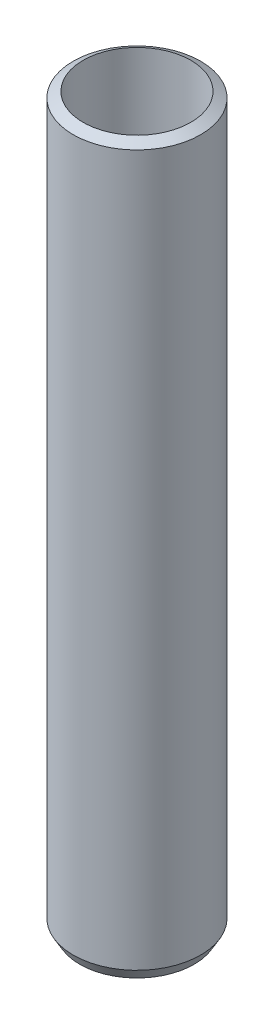
ISO-10303-21;
HEADER;
FILE_DESCRIPTION(('STEP AP214'),'2;1');
FILE_NAME('part.step','',(''),(''),'','','');
FILE_SCHEMA(('AUTOMOTIVE_DESIGN { 1 0 10303 214 1 1 1 1 }'));
ENDSEC;
DATA;
#1=APPLICATION_CONTEXT('core data for automotive mechanical design processes');
#2=APPLICATION_PROTOCOL_DEFINITION('international standard','automotive_design',2000,#1);
#3=PRODUCT_CONTEXT('',#1,'mechanical');
#4=PRODUCT('Part','Part','',(#3));
#5=PRODUCT_RELATED_PRODUCT_CATEGORY('part','',(#4));
#6=PRODUCT_DEFINITION_FORMATION('','',#4);
#7=PRODUCT_DEFINITION_CONTEXT('part definition',#1,'design');
#8=PRODUCT_DEFINITION('design','',#6,#7);
#9=PRODUCT_DEFINITION_SHAPE('','',#8);
#10=(LENGTH_UNIT() NAMED_UNIT(*) SI_UNIT(.MILLI.,.METRE.));
#11=(NAMED_UNIT(*) PLANE_ANGLE_UNIT() SI_UNIT($,.RADIAN.));
#12=(NAMED_UNIT(*) SI_UNIT($,.STERADIAN.) SOLID_ANGLE_UNIT());
#13=UNCERTAINTY_MEASURE_WITH_UNIT(LENGTH_MEASURE(1.E-05),#10,'distance_accuracy_value','');
#14=(GEOMETRIC_REPRESENTATION_CONTEXT(3) GLOBAL_UNCERTAINTY_ASSIGNED_CONTEXT((#13)) GLOBAL_UNIT_ASSIGNED_CONTEXT((#10,
#11,#12)) REPRESENTATION_CONTEXT('',''));
#15=CARTESIAN_POINT('',(0.,0.,0.));
#16=DIRECTION('',(0.,0.,1.));
#17=DIRECTION('',(1.,0.,0.));
#18=AXIS2_PLACEMENT_3D('',#15,#16,#17);
#19=CARTESIAN_POINT('',(0.,600.,0.));
#20=DIRECTION('',(0.,-1.,0.));
#21=DIRECTION('',(0.,0.,-1.));
#22=AXIS2_PLACEMENT_3D('',#19,#20,#21);
#23=CYLINDRICAL_SURFACE('',#22,52.5);
#24=CARTESIAN_POINT('',(0.,594.637356786815,0.));
#25=DIRECTION('',(0.,1.,0.));
#26=DIRECTION('',(0.,0.,1.));
#27=AXIS2_PLACEMENT_3D('',#24,#25,#26);
#28=CIRCLE('',#27,52.5);
#29=CARTESIAN_POINT('',(0.,594.637356786815,52.5));
#30=VERTEX_POINT('',#29);
#31=EDGE_CURVE('E50',#30,#30,#28,.F.);
#32=ORIENTED_EDGE('',*,*,#31,.T.);
#33=EDGE_LOOP('',(#32));
#34=FACE_BOUND('',#33,.T.);
#35=CARTESIAN_POINT('',(0.,9.28837050810138,0.));
#36=DIRECTION('',(0.,1.,0.));
#37=DIRECTION('',(0.,0.,1.));
#38=AXIS2_PLACEMENT_3D('',#35,#36,#37);
#39=CIRCLE('',#38,52.5);
#40=CARTESIAN_POINT('',(0.,9.28837050810138,52.5));
#41=VERTEX_POINT('',#40);
#42=EDGE_CURVE('E51',#41,#41,#39,.T.);
#43=ORIENTED_EDGE('',*,*,#42,.T.);
#44=EDGE_LOOP('',(#43));
#45=FACE_BOUND('',#44,.T.);
#46=ADVANCED_FACE('F39',(#34,#45),#23,.T.);
#47=CARTESIAN_POINT('',(0.,0.,0.));
#48=DIRECTION('',(0.,1.,0.));
#49=DIRECTION('',(0.,0.,1.));
#50=AXIS2_PLACEMENT_3D('',#47,#48,#49);
#51=PLANE('',#50);
#52=CARTESIAN_POINT('',(0.,0.,0.));
#53=DIRECTION('',(0.,1.,0.));
#54=DIRECTION('',(0.,0.,1.));
#55=AXIS2_PLACEMENT_3D('',#52,#53,#54);
#56=CIRCLE('',#55,47.1373567868146);
#57=CARTESIAN_POINT('',(0.,0.,47.1373567868146));
#58=VERTEX_POINT('',#57);
#59=EDGE_CURVE('E10',#58,#58,#56,.F.);
#60=ORIENTED_EDGE('',*,*,#59,.T.);
#61=EDGE_LOOP('',(#60));
#62=FACE_BOUND('',#61,.T.);
#63=CARTESIAN_POINT('',(0.,0.,0.));
#64=DIRECTION('',(0.,1.,0.));
#65=DIRECTION('',(0.,0.,1.));
#66=AXIS2_PLACEMENT_3D('',#63,#64,#65);
#67=CIRCLE('',#66,44.3340888228841);
#68=CARTESIAN_POINT('',(0.,0.,44.3340888228841));
#69=VERTEX_POINT('',#68);
#70=EDGE_CURVE('E58',#69,#69,#67,.T.);
#71=ORIENTED_EDGE('',*,*,#70,.T.);
#72=EDGE_LOOP('',(#71));
#73=FACE_BOUND('',#72,.T.);
#74=ADVANCED_FACE('F62',(#62,#73),#51,.F.);
#75=CARTESIAN_POINT('',(0.,600.,0.));
#76=DIRECTION('',(0.,-1.,0.));
#77=DIRECTION('',(0.,0.,-1.));
#78=AXIS2_PLACEMENT_3D('',#75,#76,#77);
#79=CYLINDRICAL_SURFACE('',#78,44.3340888228841);
#80=CARTESIAN_POINT('',(0.,599.351947803101,0.));
#81=DIRECTION('',(0.,-1.,0.));
#82=DIRECTION('',(0.,0.,-1.));
#83=AXIS2_PLACEMENT_3D('',#80,#81,#82);
#84=CIRCLE('',#83,44.3340888228841);
#85=CARTESIAN_POINT('',(0.,599.351947803101,-44.3340888228841));
#86=VERTEX_POINT('',#85);
#87=EDGE_CURVE('E54',#86,#86,#84,.F.);
#88=ORIENTED_EDGE('',*,*,#87,.T.);
#89=EDGE_LOOP('',(#88));
#90=FACE_BOUND('',#89,.T.);
#91=ORIENTED_EDGE('',*,*,#70,.F.);
#92=EDGE_LOOP('',(#91));
#93=FACE_BOUND('',#92,.T.);
#94=ADVANCED_FACE('F68',(#90,#93),#79,.F.);
#95=CARTESIAN_POINT('',(0.,600.,0.));
#96=DIRECTION('',(0.,-1.,0.));
#97=DIRECTION('',(0.,0.,-1.));
#98=AXIS2_PLACEMENT_3D('',#95,#96,#97);
#99=CONICAL_SURFACE('',#98,43.2116294918984,1.0471975511966);
#100=ORIENTED_EDGE('',*,*,#31,.F.);
#101=EDGE_LOOP('',(#100));
#102=FACE_BOUND('',#101,.T.);
#103=ORIENTED_EDGE('',*,*,#87,.F.);
#104=EDGE_LOOP('',(#103));
#105=FACE_BOUND('',#104,.T.);
#106=ADVANCED_FACE('F66',(#102,#105),#99,.T.);
#107=CARTESIAN_POINT('',(0.,9.28837050810138,0.));
#108=DIRECTION('',(0.,1.,0.));
#109=DIRECTION('',(0.,0.,1.));
#110=AXIS2_PLACEMENT_3D('',#107,#108,#109);
#111=CONICAL_SURFACE('',#110,52.5,0.523598775598303);
#112=ORIENTED_EDGE('',*,*,#59,.F.);
#113=EDGE_LOOP('',(#112));
#114=FACE_BOUND('',#113,.T.);
#115=ORIENTED_EDGE('',*,*,#42,.F.);
#116=EDGE_LOOP('',(#115));
#117=FACE_BOUND('',#116,.T.);
#118=ADVANCED_FACE('F45',(#114,#117),#111,.T.);
#119=CLOSED_SHELL('',(#46,#74,#94,#106,#118));
#120=MANIFOLD_SOLID_BREP('B2',#119);
#121=ADVANCED_BREP_SHAPE_REPRESENTATION('',(#18,#120),#14);
#122=SHAPE_DEFINITION_REPRESENTATION(#9,#121);
ENDSEC;
END-ISO-10303-21;
